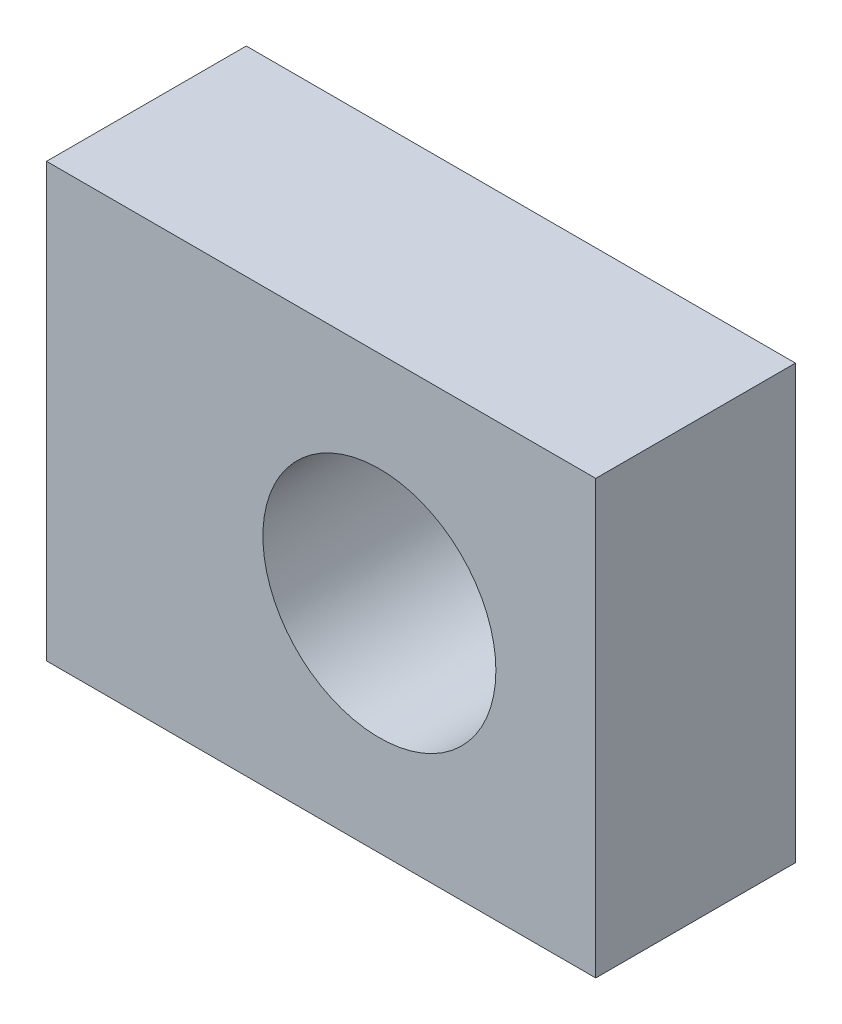
ISO-10303-21;
HEADER;
FILE_DESCRIPTION(('STEP AP214'),'2;1');
FILE_NAME('part.step','',(''),(''),'','','');
FILE_SCHEMA(('AUTOMOTIVE_DESIGN { 1 0 10303 214 1 1 1 1 }'));
ENDSEC;
DATA;
#1=APPLICATION_CONTEXT('core data for automotive mechanical design processes');
#2=APPLICATION_PROTOCOL_DEFINITION('international standard','automotive_design',2000,#1);
#3=PRODUCT_CONTEXT('',#1,'mechanical');
#4=PRODUCT('Part','Part','',(#3));
#5=PRODUCT_RELATED_PRODUCT_CATEGORY('part','',(#4));
#6=PRODUCT_DEFINITION_FORMATION('','',#4);
#7=PRODUCT_DEFINITION_CONTEXT('part definition',#1,'design');
#8=PRODUCT_DEFINITION('design','',#6,#7);
#9=PRODUCT_DEFINITION_SHAPE('','',#8);
#10=(LENGTH_UNIT() NAMED_UNIT(*) SI_UNIT(.MILLI.,.METRE.));
#11=(NAMED_UNIT(*) PLANE_ANGLE_UNIT() SI_UNIT($,.RADIAN.));
#12=(NAMED_UNIT(*) SI_UNIT($,.STERADIAN.) SOLID_ANGLE_UNIT());
#13=UNCERTAINTY_MEASURE_WITH_UNIT(LENGTH_MEASURE(1.E-05),#10,'distance_accuracy_value','');
#14=(GEOMETRIC_REPRESENTATION_CONTEXT(3) GLOBAL_UNCERTAINTY_ASSIGNED_CONTEXT((#13)) GLOBAL_UNIT_ASSIGNED_CONTEXT((#10,
#11,#12)) REPRESENTATION_CONTEXT('',''));
#15=CARTESIAN_POINT('',(0.,0.,0.));
#16=DIRECTION('',(0.,0.,1.));
#17=DIRECTION('',(1.,0.,0.));
#18=AXIS2_PLACEMENT_3D('',#15,#16,#17);
#19=CARTESIAN_POINT('',(16.5,13.,12.));
#20=DIRECTION('',(-1.,0.,0.));
#21=DIRECTION('',(0.,-1.,0.));
#22=AXIS2_PLACEMENT_3D('',#19,#20,#21);
#23=PLANE('',#22);
#24=DIRECTION('',(0.,1.,0.));
#25=VECTOR('',#24,1.);
#26=CARTESIAN_POINT('',(16.5,13.,0.));
#27=LINE('',#26,#25);
#28=CARTESIAN_POINT('',(16.5,-13.,0.));
#29=VERTEX_POINT('',#28);
#30=CARTESIAN_POINT('',(16.5,13.,0.));
#31=VERTEX_POINT('',#30);
#32=EDGE_CURVE('E97',#29,#31,#27,.T.);
#33=ORIENTED_EDGE('',*,*,#32,.T.);
#34=DIRECTION('',(0.,0.,-1.));
#35=VECTOR('',#34,1.);
#36=CARTESIAN_POINT('',(16.5,13.,12.));
#37=LINE('',#36,#35);
#38=CARTESIAN_POINT('',(16.5,13.,12.));
#39=VERTEX_POINT('',#38);
#40=EDGE_CURVE('E11',#39,#31,#37,.T.);
#41=ORIENTED_EDGE('',*,*,#40,.F.);
#42=DIRECTION('',(0.,1.,0.));
#43=VECTOR('',#42,1.);
#44=CARTESIAN_POINT('',(16.5,13.,12.));
#45=LINE('',#44,#43);
#46=CARTESIAN_POINT('',(16.5,-13.,12.));
#47=VERTEX_POINT('',#46);
#48=EDGE_CURVE('E85',#47,#39,#45,.T.);
#49=ORIENTED_EDGE('',*,*,#48,.F.);
#50=DIRECTION('',(0.,0.,-1.));
#51=VECTOR('',#50,1.);
#52=CARTESIAN_POINT('',(16.5,-13.,12.));
#53=LINE('',#52,#51);
#54=EDGE_CURVE('E93',#47,#29,#53,.T.);
#55=ORIENTED_EDGE('',*,*,#54,.T.);
#56=EDGE_LOOP('',(#33,#41,#49,#55));
#57=FACE_BOUND('',#56,.T.);
#58=ADVANCED_FACE('F34',(#57),#23,.F.);
#59=CARTESIAN_POINT('',(-16.5,13.,12.));
#60=DIRECTION('',(0.,-1.,0.));
#61=DIRECTION('',(0.,0.,-1.));
#62=AXIS2_PLACEMENT_3D('',#59,#60,#61);
#63=PLANE('',#62);
#64=DIRECTION('',(-1.,0.,0.));
#65=VECTOR('',#64,1.);
#66=CARTESIAN_POINT('',(-16.5,13.,0.));
#67=LINE('',#66,#65);
#68=CARTESIAN_POINT('',(-16.5,13.,0.));
#69=VERTEX_POINT('',#68);
#70=EDGE_CURVE('E89',#31,#69,#67,.T.);
#71=ORIENTED_EDGE('',*,*,#70,.T.);
#72=DIRECTION('',(0.,0.,-1.));
#73=VECTOR('',#72,1.);
#74=CARTESIAN_POINT('',(-16.5,13.,12.));
#75=LINE('',#74,#73);
#76=CARTESIAN_POINT('',(-16.5,13.,12.));
#77=VERTEX_POINT('',#76);
#78=EDGE_CURVE('E42',#77,#69,#75,.T.);
#79=ORIENTED_EDGE('',*,*,#78,.F.);
#80=DIRECTION('',(-1.,0.,0.));
#81=VECTOR('',#80,1.);
#82=CARTESIAN_POINT('',(-16.5,13.,12.));
#83=LINE('',#82,#81);
#84=EDGE_CURVE('E80',#39,#77,#83,.T.);
#85=ORIENTED_EDGE('',*,*,#84,.F.);
#86=ORIENTED_EDGE('',*,*,#40,.T.);
#87=EDGE_LOOP('',(#71,#79,#85,#86));
#88=FACE_BOUND('',#87,.T.);
#89=ADVANCED_FACE('F88',(#88),#63,.F.);
#90=CARTESIAN_POINT('',(-16.5,13.,12.));
#91=DIRECTION('',(1.,0.,0.));
#92=DIRECTION('',(0.,1.,0.));
#93=AXIS2_PLACEMENT_3D('',#90,#91,#92);
#94=PLANE('',#93);
#95=DIRECTION('',(0.,-1.,0.));
#96=VECTOR('',#95,1.);
#97=CARTESIAN_POINT('',(-16.5,13.,0.));
#98=LINE('',#97,#96);
#99=CARTESIAN_POINT('',(-16.5,-13.,0.));
#100=VERTEX_POINT('',#99);
#101=EDGE_CURVE('E67',#69,#100,#98,.T.);
#102=ORIENTED_EDGE('',*,*,#101,.T.);
#103=DIRECTION('',(0.,0.,-1.));
#104=VECTOR('',#103,1.);
#105=CARTESIAN_POINT('',(-16.5,-13.,12.));
#106=LINE('',#105,#104);
#107=CARTESIAN_POINT('',(-16.5,-13.,12.));
#108=VERTEX_POINT('',#107);
#109=EDGE_CURVE('E90',#108,#100,#106,.T.);
#110=ORIENTED_EDGE('',*,*,#109,.F.);
#111=DIRECTION('',(0.,-1.,0.));
#112=VECTOR('',#111,1.);
#113=CARTESIAN_POINT('',(-16.5,13.,12.));
#114=LINE('',#113,#112);
#115=EDGE_CURVE('E83',#77,#108,#114,.T.);
#116=ORIENTED_EDGE('',*,*,#115,.F.);
#117=ORIENTED_EDGE('',*,*,#78,.T.);
#118=EDGE_LOOP('',(#102,#110,#116,#117));
#119=FACE_BOUND('',#118,.T.);
#120=ADVANCED_FACE('F91',(#119),#94,.F.);
#121=CARTESIAN_POINT('',(-16.5,-13.,12.));
#122=DIRECTION('',(0.,1.,0.));
#123=DIRECTION('',(0.,0.,1.));
#124=AXIS2_PLACEMENT_3D('',#121,#122,#123);
#125=PLANE('',#124);
#126=DIRECTION('',(1.,0.,0.));
#127=VECTOR('',#126,1.);
#128=CARTESIAN_POINT('',(-16.5,-13.,0.));
#129=LINE('',#128,#127);
#130=EDGE_CURVE('E73',#100,#29,#129,.T.);
#131=ORIENTED_EDGE('',*,*,#130,.T.);
#132=ORIENTED_EDGE('',*,*,#54,.F.);
#133=DIRECTION('',(1.,0.,0.));
#134=VECTOR('',#133,1.);
#135=CARTESIAN_POINT('',(-16.5,-13.,12.));
#136=LINE('',#135,#134);
#137=EDGE_CURVE('E50',#108,#47,#136,.T.);
#138=ORIENTED_EDGE('',*,*,#137,.F.);
#139=ORIENTED_EDGE('',*,*,#109,.T.);
#140=EDGE_LOOP('',(#131,#132,#138,#139));
#141=FACE_BOUND('',#140,.T.);
#142=ADVANCED_FACE('F105',(#141),#125,.F.);
#143=CARTESIAN_POINT('',(0.,0.,12.));
#144=DIRECTION('',(0.,0.,1.));
#145=DIRECTION('',(1.,0.,0.));
#146=AXIS2_PLACEMENT_3D('',#143,#144,#145);
#147=PLANE('',#146);
#148=CARTESIAN_POINT('',(3.5,0.,12.));
#149=DIRECTION('',(0.,0.,1.));
#150=DIRECTION('',(1.,0.,0.));
#151=AXIS2_PLACEMENT_3D('',#148,#149,#150);
#152=CIRCLE('',#151,7.);
#153=CARTESIAN_POINT('',(10.5,0.,12.));
#154=VERTEX_POINT('',#153);
#155=EDGE_CURVE('E111',#154,#154,#152,.T.);
#156=ORIENTED_EDGE('',*,*,#155,.F.);
#157=EDGE_LOOP('',(#156));
#158=FACE_BOUND('',#157,.T.);
#159=ORIENTED_EDGE('',*,*,#48,.T.);
#160=ORIENTED_EDGE('',*,*,#84,.T.);
#161=ORIENTED_EDGE('',*,*,#115,.T.);
#162=ORIENTED_EDGE('',*,*,#137,.T.);
#163=EDGE_LOOP('',(#159,#160,#161,#162));
#164=FACE_BOUND('',#163,.T.);
#165=ADVANCED_FACE('F81',(#158,#164),#147,.T.);
#166=CARTESIAN_POINT('',(0.,0.,0.));
#167=DIRECTION('',(0.,0.,1.));
#168=DIRECTION('',(1.,0.,0.));
#169=AXIS2_PLACEMENT_3D('',#166,#167,#168);
#170=PLANE('',#169);
#171=CARTESIAN_POINT('',(3.5,0.,0.));
#172=DIRECTION('',(0.,0.,1.));
#173=DIRECTION('',(1.,0.,0.));
#174=AXIS2_PLACEMENT_3D('',#171,#172,#173);
#175=CIRCLE('',#174,7.);
#176=CARTESIAN_POINT('',(10.5,0.,0.));
#177=VERTEX_POINT('',#176);
#178=EDGE_CURVE('E100',#177,#177,#175,.T.);
#179=ORIENTED_EDGE('',*,*,#178,.T.);
#180=EDGE_LOOP('',(#179));
#181=FACE_BOUND('',#180,.T.);
#182=ORIENTED_EDGE('',*,*,#32,.F.);
#183=ORIENTED_EDGE('',*,*,#130,.F.);
#184=ORIENTED_EDGE('',*,*,#101,.F.);
#185=ORIENTED_EDGE('',*,*,#70,.F.);
#186=EDGE_LOOP('',(#182,#183,#184,#185));
#187=FACE_BOUND('',#186,.T.);
#188=ADVANCED_FACE('F108',(#181,#187),#170,.F.);
#189=CARTESIAN_POINT('',(3.5,0.,0.));
#190=DIRECTION('',(0.,0.,1.));
#191=DIRECTION('',(1.,0.,0.));
#192=AXIS2_PLACEMENT_3D('',#189,#190,#191);
#193=CYLINDRICAL_SURFACE('',#192,7.);
#194=ORIENTED_EDGE('',*,*,#178,.F.);
#195=EDGE_LOOP('',(#194));
#196=FACE_BOUND('',#195,.T.);
#197=ORIENTED_EDGE('',*,*,#155,.T.);
#198=EDGE_LOOP('',(#197));
#199=FACE_BOUND('',#198,.T.);
#200=ADVANCED_FACE('F118',(#196,#199),#193,.F.);
#201=CLOSED_SHELL('',(#58,#89,#120,#142,#165,#188,#200));
#202=MANIFOLD_SOLID_BREP('B2',#201);
#203=ADVANCED_BREP_SHAPE_REPRESENTATION('',(#18,#202),#14);
#204=SHAPE_DEFINITION_REPRESENTATION(#9,#203);
ENDSEC;
END-ISO-10303-21;
